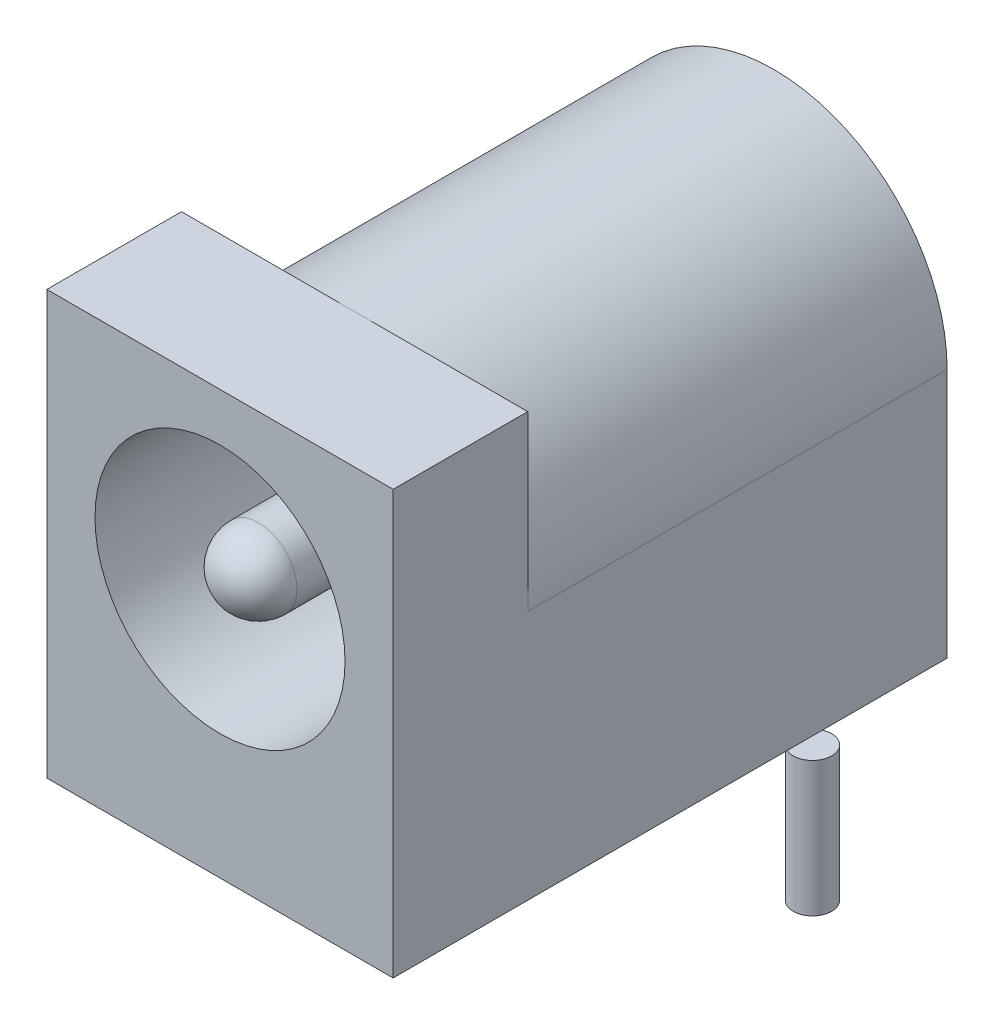
ISO-10303-21;
HEADER;
FILE_DESCRIPTION(('STEP AP214'),'2;1');
FILE_NAME('part.step','',(''),(''),'','','');
FILE_SCHEMA(('AUTOMOTIVE_DESIGN { 1 0 10303 214 1 1 1 1 }'));
ENDSEC;
DATA;
#1=APPLICATION_CONTEXT('core data for automotive mechanical design processes');
#2=APPLICATION_PROTOCOL_DEFINITION('international standard','automotive_design',2000,#1);
#3=PRODUCT_CONTEXT('',#1,'mechanical');
#4=PRODUCT('Part','Part','',(#3));
#5=PRODUCT_RELATED_PRODUCT_CATEGORY('part','',(#4));
#6=PRODUCT_DEFINITION_FORMATION('','',#4);
#7=PRODUCT_DEFINITION_CONTEXT('part definition',#1,'design');
#8=PRODUCT_DEFINITION('design','',#6,#7);
#9=PRODUCT_DEFINITION_SHAPE('','',#8);
#10=(LENGTH_UNIT() NAMED_UNIT(*) SI_UNIT(.MILLI.,.METRE.));
#11=(NAMED_UNIT(*) PLANE_ANGLE_UNIT() SI_UNIT($,.RADIAN.));
#12=(NAMED_UNIT(*) SI_UNIT($,.STERADIAN.) SOLID_ANGLE_UNIT());
#13=UNCERTAINTY_MEASURE_WITH_UNIT(LENGTH_MEASURE(1.E-05),#10,'distance_accuracy_value','');
#14=(GEOMETRIC_REPRESENTATION_CONTEXT(3) GLOBAL_UNCERTAINTY_ASSIGNED_CONTEXT((#13)) GLOBAL_UNIT_ASSIGNED_CONTEXT((#10,
#11,#12)) REPRESENTATION_CONTEXT('',''));
#15=CARTESIAN_POINT('',(0.,0.,0.));
#16=DIRECTION('',(0.,0.,1.));
#17=DIRECTION('',(1.,0.,0.));
#18=AXIS2_PLACEMENT_3D('',#15,#16,#17);
#19=CARTESIAN_POINT('',(-4.5,0.,-14.4));
#20=DIRECTION('',(-1.,0.,0.));
#21=DIRECTION('',(0.,0.,1.));
#22=AXIS2_PLACEMENT_3D('',#19,#20,#21);
#23=PLANE('',#22);
#24=DIRECTION('',(0.,-1.,0.));
#25=VECTOR('',#24,1.);
#26=CARTESIAN_POINT('',(-4.5,0.,0.));
#27=LINE('',#26,#25);
#28=CARTESIAN_POINT('',(-4.5,11.,0.));
#29=VERTEX_POINT('',#28);
#30=CARTESIAN_POINT('',(-4.5,0.,0.));
#31=VERTEX_POINT('',#30);
#32=EDGE_CURVE('E145',#29,#31,#27,.T.);
#33=ORIENTED_EDGE('',*,*,#32,.F.);
#34=DIRECTION('',(0.,0.,1.));
#35=VECTOR('',#34,1.);
#36=CARTESIAN_POINT('',(-4.5,11.,-3.5));
#37=LINE('',#36,#35);
#38=CARTESIAN_POINT('',(-4.5,11.,-3.5));
#39=VERTEX_POINT('',#38);
#40=EDGE_CURVE('E147',#39,#29,#37,.T.);
#41=ORIENTED_EDGE('',*,*,#40,.F.);
#42=DIRECTION('',(0.,-1.,0.));
#43=VECTOR('',#42,1.);
#44=CARTESIAN_POINT('',(-4.5,6.5,-3.5));
#45=LINE('',#44,#43);
#46=CARTESIAN_POINT('',(-4.5,6.5,-3.5));
#47=VERTEX_POINT('',#46);
#48=EDGE_CURVE('E160',#39,#47,#45,.T.);
#49=ORIENTED_EDGE('',*,*,#48,.T.);
#50=DIRECTION('',(0.,0.,1.));
#51=VECTOR('',#50,1.);
#52=CARTESIAN_POINT('',(-4.5,6.5,-14.4));
#53=LINE('',#52,#51);
#54=CARTESIAN_POINT('',(-4.5,6.5,-14.4));
#55=VERTEX_POINT('',#54);
#56=EDGE_CURVE('E58',#55,#47,#53,.T.);
#57=ORIENTED_EDGE('',*,*,#56,.F.);
#58=DIRECTION('',(0.,-1.,0.));
#59=VECTOR('',#58,1.);
#60=CARTESIAN_POINT('',(-4.5,0.,-14.4));
#61=LINE('',#60,#59);
#62=CARTESIAN_POINT('',(-4.5,0.,-14.4));
#63=VERTEX_POINT('',#62);
#64=EDGE_CURVE('E141',#55,#63,#61,.T.);
#65=ORIENTED_EDGE('',*,*,#64,.T.);
#66=DIRECTION('',(0.,0.,1.));
#67=VECTOR('',#66,1.);
#68=CARTESIAN_POINT('',(-4.5,0.,-14.4));
#69=LINE('',#68,#67);
#70=EDGE_CURVE('E80',#63,#31,#69,.T.);
#71=ORIENTED_EDGE('',*,*,#70,.T.);
#72=EDGE_LOOP('',(#33,#41,#49,#57,#65,#71));
#73=FACE_BOUND('',#72,.T.);
#74=ADVANCED_FACE('F35',(#73),#23,.T.);
#75=CARTESIAN_POINT('',(0.,6.5,-14.4));
#76=DIRECTION('',(0.,0.,1.));
#77=DIRECTION('',(1.,0.,0.));
#78=AXIS2_PLACEMENT_3D('',#75,#76,#77);
#79=CYLINDRICAL_SURFACE('',#78,4.5);
#80=CARTESIAN_POINT('',(0.,6.5,-3.5));
#81=DIRECTION('',(0.,0.,-1.));
#82=DIRECTION('',(-1.,0.,0.));
#83=AXIS2_PLACEMENT_3D('',#80,#81,#82);
#84=CIRCLE('',#83,4.5);
#85=CARTESIAN_POINT('',(4.5,6.5,-3.5));
#86=VERTEX_POINT('',#85);
#87=CARTESIAN_POINT('',(0.,11.,-3.5));
#88=VERTEX_POINT('',#87);
#89=EDGE_CURVE('E43',#86,#88,#84,.F.);
#90=ORIENTED_EDGE('',*,*,#89,.F.);
#91=DIRECTION('',(0.,0.,1.));
#92=VECTOR('',#91,1.);
#93=CARTESIAN_POINT('',(4.5,6.5,-14.4));
#94=LINE('',#93,#92);
#95=CARTESIAN_POINT('',(4.5,6.5,-14.4));
#96=VERTEX_POINT('',#95);
#97=EDGE_CURVE('E122',#96,#86,#94,.T.);
#98=ORIENTED_EDGE('',*,*,#97,.F.);
#99=CARTESIAN_POINT('',(0.,6.5,-14.4));
#100=DIRECTION('',(0.,0.,1.));
#101=DIRECTION('',(-1.,0.,0.));
#102=AXIS2_PLACEMENT_3D('',#99,#100,#101);
#103=CIRCLE('',#102,4.5);
#104=EDGE_CURVE('E126',#96,#55,#103,.T.);
#105=ORIENTED_EDGE('',*,*,#104,.T.);
#106=ORIENTED_EDGE('',*,*,#56,.T.);
#107=EDGE_CURVE('E131',#88,#47,#84,.F.);
#108=ORIENTED_EDGE('',*,*,#107,.F.);
#109=EDGE_LOOP('',(#90,#98,#105,#106,#108));
#110=FACE_BOUND('',#109,.T.);
#111=ADVANCED_FACE('F207',(#110),#79,.T.);
#112=CARTESIAN_POINT('',(4.5,6.5,-14.4));
#113=DIRECTION('',(1.,0.,0.));
#114=DIRECTION('',(0.,1.,0.));
#115=AXIS2_PLACEMENT_3D('',#112,#113,#114);
#116=PLANE('',#115);
#117=DIRECTION('',(0.,1.,0.));
#118=VECTOR('',#117,1.);
#119=CARTESIAN_POINT('',(4.5,6.5,0.));
#120=LINE('',#119,#118);
#121=CARTESIAN_POINT('',(4.5,0.,0.));
#122=VERTEX_POINT('',#121);
#123=CARTESIAN_POINT('',(4.5,11.,0.));
#124=VERTEX_POINT('',#123);
#125=EDGE_CURVE('E139',#122,#124,#120,.T.);
#126=ORIENTED_EDGE('',*,*,#125,.F.);
#127=DIRECTION('',(0.,0.,1.));
#128=VECTOR('',#127,1.);
#129=CARTESIAN_POINT('',(4.5,0.,-14.4));
#130=LINE('',#129,#128);
#131=CARTESIAN_POINT('',(4.5,0.,-10.2417424305044));
#132=VERTEX_POINT('',#131);
#133=EDGE_CURVE('E75',#132,#122,#130,.T.);
#134=ORIENTED_EDGE('',*,*,#133,.F.);
#135=CARTESIAN_POINT('',(4.5,0.,-11.1582575694956));
#136=VERTEX_POINT('',#135);
#137=EDGE_CURVE('E108',#136,#132,#130,.T.);
#138=ORIENTED_EDGE('',*,*,#137,.F.);
#139=CARTESIAN_POINT('',(4.5,0.,-14.4));
#140=VERTEX_POINT('',#139);
#141=EDGE_CURVE('E117',#140,#136,#130,.T.);
#142=ORIENTED_EDGE('',*,*,#141,.F.);
#143=DIRECTION('',(0.,1.,0.));
#144=VECTOR('',#143,1.);
#145=CARTESIAN_POINT('',(4.5,6.5,-14.4));
#146=LINE('',#145,#144);
#147=EDGE_CURVE('E129',#140,#96,#146,.T.);
#148=ORIENTED_EDGE('',*,*,#147,.T.);
#149=ORIENTED_EDGE('',*,*,#97,.T.);
#150=DIRECTION('',(0.,1.,0.));
#151=VECTOR('',#150,1.);
#152=CARTESIAN_POINT('',(4.5,6.5,-3.5));
#153=LINE('',#152,#151);
#154=CARTESIAN_POINT('',(4.5,11.,-3.5));
#155=VERTEX_POINT('',#154);
#156=EDGE_CURVE('E165',#86,#155,#153,.T.);
#157=ORIENTED_EDGE('',*,*,#156,.T.);
#158=DIRECTION('',(0.,0.,1.));
#159=VECTOR('',#158,1.);
#160=CARTESIAN_POINT('',(4.5,11.,-3.5));
#161=LINE('',#160,#159);
#162=EDGE_CURVE('E152',#155,#124,#161,.T.);
#163=ORIENTED_EDGE('',*,*,#162,.T.);
#164=EDGE_LOOP('',(#126,#134,#138,#142,#148,#149,#157,#163));
#165=FACE_BOUND('',#164,.T.);
#166=ADVANCED_FACE('F115',(#165),#116,.T.);
#167=CARTESIAN_POINT('',(4.5,0.,-14.4));
#168=DIRECTION('',(0.,-1.,0.));
#169=DIRECTION('',(0.,0.,-1.));
#170=AXIS2_PLACEMENT_3D('',#167,#168,#169);
#171=PLANE('',#170);
#172=CARTESIAN_POINT('',(0.,0.,-7.7));
#173=DIRECTION('',(0.,-1.,0.));
#174=DIRECTION('',(0.,0.,-1.));
#175=AXIS2_PLACEMENT_3D('',#172,#173,#174);
#176=CIRCLE('',#175,0.500000000000001);
#177=CARTESIAN_POINT('',(0.,0.,-8.2));
#178=VERTEX_POINT('',#177);
#179=EDGE_CURVE('E184',#178,#178,#176,.T.);
#180=ORIENTED_EDGE('',*,*,#179,.F.);
#181=EDGE_LOOP('',(#180));
#182=FACE_BOUND('',#181,.T.);
#183=CARTESIAN_POINT('',(0.,0.,-13.7));
#184=DIRECTION('',(0.,-1.,0.));
#185=DIRECTION('',(0.,0.,-1.));
#186=AXIS2_PLACEMENT_3D('',#183,#184,#185);
#187=CIRCLE('',#186,0.5);
#188=CARTESIAN_POINT('',(0.,0.,-14.2));
#189=VERTEX_POINT('',#188);
#190=EDGE_CURVE('E178',#189,#189,#187,.T.);
#191=ORIENTED_EDGE('',*,*,#190,.F.);
#192=EDGE_LOOP('',(#191));
#193=FACE_BOUND('',#192,.T.);
#194=ORIENTED_EDGE('',*,*,#141,.T.);
#195=CARTESIAN_POINT('',(4.7,0.,-10.7));
#196=DIRECTION('',(0.,-1.,0.));
#197=DIRECTION('',(0.,0.,-1.));
#198=AXIS2_PLACEMENT_3D('',#195,#196,#197);
#199=CIRCLE('',#198,0.500000000000002);
#200=EDGE_CURVE('E109',#132,#136,#199,.T.);
#201=ORIENTED_EDGE('',*,*,#200,.F.);
#202=ORIENTED_EDGE('',*,*,#133,.T.);
#203=DIRECTION('',(1.,0.,0.));
#204=VECTOR('',#203,1.);
#205=CARTESIAN_POINT('',(4.5,0.,0.));
#206=LINE('',#205,#204);
#207=EDGE_CURVE('E142',#31,#122,#206,.T.);
#208=ORIENTED_EDGE('',*,*,#207,.F.);
#209=ORIENTED_EDGE('',*,*,#70,.F.);
#210=DIRECTION('',(1.,0.,0.));
#211=VECTOR('',#210,1.);
#212=CARTESIAN_POINT('',(4.5,0.,-14.4));
#213=LINE('',#212,#211);
#214=EDGE_CURVE('E121',#63,#140,#213,.T.);
#215=ORIENTED_EDGE('',*,*,#214,.T.);
#216=EDGE_LOOP('',(#194,#201,#202,#208,#209,#215));
#217=FACE_BOUND('',#216,.T.);
#218=ADVANCED_FACE('F120',(#182,#193,#217),#171,.T.);
#219=CARTESIAN_POINT('',(0.,6.5,-14.4));
#220=DIRECTION('',(0.,0.,-1.));
#221=DIRECTION('',(-1.,0.,0.));
#222=AXIS2_PLACEMENT_3D('',#219,#220,#221);
#223=PLANE('',#222);
#224=ORIENTED_EDGE('',*,*,#64,.F.);
#225=ORIENTED_EDGE('',*,*,#104,.F.);
#226=ORIENTED_EDGE('',*,*,#147,.F.);
#227=ORIENTED_EDGE('',*,*,#214,.F.);
#228=EDGE_LOOP('',(#224,#225,#226,#227));
#229=FACE_BOUND('',#228,.T.);
#230=ADVANCED_FACE('F215',(#229),#223,.T.);
#231=CARTESIAN_POINT('',(0.,6.5,0.));
#232=DIRECTION('',(0.,0.,-1.));
#233=DIRECTION('',(-1.,0.,0.));
#234=AXIS2_PLACEMENT_3D('',#231,#232,#233);
#235=PLANE('',#234);
#236=CARTESIAN_POINT('',(0.,6.5,0.));
#237=DIRECTION('',(0.,0.,1.));
#238=DIRECTION('',(1.,0.,0.));
#239=AXIS2_PLACEMENT_3D('',#236,#237,#238);
#240=CIRCLE('',#239,3.25);
#241=CARTESIAN_POINT('',(3.25,6.5,0.));
#242=VERTEX_POINT('',#241);
#243=EDGE_CURVE('E169',#242,#242,#240,.T.);
#244=ORIENTED_EDGE('',*,*,#243,.F.);
#245=EDGE_LOOP('',(#244));
#246=FACE_BOUND('',#245,.T.);
#247=ORIENTED_EDGE('',*,*,#125,.T.);
#248=DIRECTION('',(-1.,0.,0.));
#249=VECTOR('',#248,1.);
#250=CARTESIAN_POINT('',(-4.5,11.,0.));
#251=LINE('',#250,#249);
#252=EDGE_CURVE('E158',#124,#29,#251,.T.);
#253=ORIENTED_EDGE('',*,*,#252,.T.);
#254=ORIENTED_EDGE('',*,*,#32,.T.);
#255=ORIENTED_EDGE('',*,*,#207,.T.);
#256=EDGE_LOOP('',(#247,#253,#254,#255));
#257=FACE_BOUND('',#256,.T.);
#258=ADVANCED_FACE('F219',(#246,#257),#235,.F.);
#259=CARTESIAN_POINT('',(0.,0.,-3.5));
#260=DIRECTION('',(0.,0.,-1.));
#261=DIRECTION('',(-1.,0.,0.));
#262=AXIS2_PLACEMENT_3D('',#259,#260,#261);
#263=PLANE('',#262);
#264=ORIENTED_EDGE('',*,*,#156,.F.);
#265=ORIENTED_EDGE('',*,*,#89,.T.);
#266=DIRECTION('',(-1.,0.,0.));
#267=VECTOR('',#266,1.);
#268=CARTESIAN_POINT('',(-4.5,11.,-3.5));
#269=LINE('',#268,#267);
#270=EDGE_CURVE('E155',#155,#88,#269,.T.);
#271=ORIENTED_EDGE('',*,*,#270,.F.);
#272=EDGE_LOOP('',(#264,#265,#271));
#273=FACE_BOUND('',#272,.T.);
#274=ADVANCED_FACE('F222',(#273),#263,.T.);
#275=CARTESIAN_POINT('',(-4.5,11.,-3.5));
#276=DIRECTION('',(0.,1.,0.));
#277=DIRECTION('',(0.,0.,1.));
#278=AXIS2_PLACEMENT_3D('',#275,#276,#277);
#279=PLANE('',#278);
#280=ORIENTED_EDGE('',*,*,#270,.T.);
#281=EDGE_CURVE('E164',#88,#39,#269,.T.);
#282=ORIENTED_EDGE('',*,*,#281,.T.);
#283=ORIENTED_EDGE('',*,*,#40,.T.);
#284=ORIENTED_EDGE('',*,*,#252,.F.);
#285=ORIENTED_EDGE('',*,*,#162,.F.);
#286=EDGE_LOOP('',(#280,#282,#283,#284,#285));
#287=FACE_BOUND('',#286,.T.);
#288=ADVANCED_FACE('F227',(#287),#279,.T.);
#289=ORIENTED_EDGE('',*,*,#281,.F.);
#290=ORIENTED_EDGE('',*,*,#107,.T.);
#291=ORIENTED_EDGE('',*,*,#48,.F.);
#292=EDGE_LOOP('',(#289,#290,#291));
#293=FACE_BOUND('',#292,.T.);
#294=ADVANCED_FACE('F230',(#293),#263,.T.);
#295=CARTESIAN_POINT('',(0.,6.5,-10.));
#296=DIRECTION('',(0.,0.,1.));
#297=DIRECTION('',(1.,0.,0.));
#298=AXIS2_PLACEMENT_3D('',#295,#296,#297);
#299=CYLINDRICAL_SURFACE('',#298,3.25);
#300=CARTESIAN_POINT('',(0.,6.5,-10.));
#301=DIRECTION('',(0.,0.,1.));
#302=DIRECTION('',(1.,0.,0.));
#303=AXIS2_PLACEMENT_3D('',#300,#301,#302);
#304=CIRCLE('',#303,3.25);
#305=CARTESIAN_POINT('',(3.25,6.5,-10.));
#306=VERTEX_POINT('',#305);
#307=EDGE_CURVE('E161',#306,#306,#304,.T.);
#308=ORIENTED_EDGE('',*,*,#307,.F.);
#309=EDGE_LOOP('',(#308));
#310=FACE_BOUND('',#309,.T.);
#311=ORIENTED_EDGE('',*,*,#243,.T.);
#312=EDGE_LOOP('',(#311));
#313=FACE_BOUND('',#312,.T.);
#314=ADVANCED_FACE('F234',(#310,#313),#299,.F.);
#315=CARTESIAN_POINT('',(0.,6.5,-10.));
#316=DIRECTION('',(0.,0.,1.));
#317=DIRECTION('',(1.,0.,0.));
#318=AXIS2_PLACEMENT_3D('',#315,#316,#317);
#319=PLANE('',#318);
#320=CARTESIAN_POINT('',(0.,6.5,-10.));
#321=DIRECTION('',(0.,0.,1.));
#322=DIRECTION('',(1.,0.,0.));
#323=AXIS2_PLACEMENT_3D('',#320,#321,#322);
#324=CIRCLE('',#323,1.);
#325=CARTESIAN_POINT('',(0.999999999999998,6.5,-10.));
#326=VERTEX_POINT('',#325);
#327=EDGE_CURVE('E172',#326,#326,#324,.T.);
#328=ORIENTED_EDGE('',*,*,#327,.F.);
#329=EDGE_LOOP('',(#328));
#330=FACE_BOUND('',#329,.T.);
#331=ORIENTED_EDGE('',*,*,#307,.T.);
#332=EDGE_LOOP('',(#331));
#333=FACE_BOUND('',#332,.T.);
#334=ADVANCED_FACE('F237',(#330,#333),#319,.T.);
#335=CARTESIAN_POINT('',(0.,6.5,-10.));
#336=DIRECTION('',(0.,0.,1.));
#337=DIRECTION('',(1.,0.,0.));
#338=AXIS2_PLACEMENT_3D('',#335,#336,#337);
#339=CYLINDRICAL_SURFACE('',#338,1.);
#340=CARTESIAN_POINT('',(0.,6.5,-0.999999999999999));
#341=DIRECTION('',(0.,0.,1.));
#342=DIRECTION('',(1.,0.,0.));
#343=AXIS2_PLACEMENT_3D('',#340,#341,#342);
#344=CIRCLE('',#343,1.);
#345=CARTESIAN_POINT('',(0.999999999999998,6.5,-0.999999999999999));
#346=VERTEX_POINT('',#345);
#347=EDGE_CURVE('E11',#346,#346,#344,.F.);
#348=ORIENTED_EDGE('',*,*,#347,.T.);
#349=EDGE_LOOP('',(#348));
#350=FACE_BOUND('',#349,.T.);
#351=ORIENTED_EDGE('',*,*,#327,.T.);
#352=EDGE_LOOP('',(#351));
#353=FACE_BOUND('',#352,.T.);
#354=ADVANCED_FACE('F241',(#350,#353),#339,.T.);
#355=CARTESIAN_POINT('',(0.,6.5,-0.999999999999999));
#356=DIRECTION('',(0.,0.,-1.));
#357=DIRECTION('',(-1.,0.,0.));
#358=AXIS2_PLACEMENT_3D('',#355,#356,#357);
#359=SPHERICAL_SURFACE('',#358,1.);
#360=ORIENTED_EDGE('',*,*,#347,.F.);
#361=EDGE_LOOP('',(#360));
#362=FACE_BOUND('',#361,.T.);
#363=ADVANCED_FACE('F37',(#362),#359,.T.);
#364=CARTESIAN_POINT('',(0.,-3.5,-13.7));
#365=DIRECTION('',(0.,1.,0.));
#366=DIRECTION('',(0.,0.,1.));
#367=AXIS2_PLACEMENT_3D('',#364,#365,#366);
#368=CYLINDRICAL_SURFACE('',#367,0.5);
#369=CARTESIAN_POINT('',(0.,-3.5,-13.7));
#370=DIRECTION('',(0.,-1.,0.));
#371=DIRECTION('',(0.,0.,-1.));
#372=AXIS2_PLACEMENT_3D('',#369,#370,#371);
#373=CIRCLE('',#372,0.5);
#374=CARTESIAN_POINT('',(0.,-3.5,-14.2));
#375=VERTEX_POINT('',#374);
#376=EDGE_CURVE('E177',#375,#375,#373,.T.);
#377=ORIENTED_EDGE('',*,*,#376,.F.);
#378=EDGE_LOOP('',(#377));
#379=FACE_BOUND('',#378,.T.);
#380=ORIENTED_EDGE('',*,*,#190,.T.);
#381=EDGE_LOOP('',(#380));
#382=FACE_BOUND('',#381,.T.);
#383=ADVANCED_FACE('F246',(#379,#382),#368,.T.);
#384=CARTESIAN_POINT('',(0.,-3.5,-13.7));
#385=DIRECTION('',(0.,-1.,0.));
#386=DIRECTION('',(0.,0.,-1.));
#387=AXIS2_PLACEMENT_3D('',#384,#385,#386);
#388=PLANE('',#387);
#389=ORIENTED_EDGE('',*,*,#376,.T.);
#390=EDGE_LOOP('',(#389));
#391=FACE_BOUND('',#390,.T.);
#392=ADVANCED_FACE('F249',(#391),#388,.T.);
#393=CARTESIAN_POINT('',(0.,-3.5,-7.7));
#394=DIRECTION('',(0.,1.,0.));
#395=DIRECTION('',(0.,0.,1.));
#396=AXIS2_PLACEMENT_3D('',#393,#394,#395);
#397=CYLINDRICAL_SURFACE('',#396,0.500000000000001);
#398=CARTESIAN_POINT('',(0.,-3.5,-7.7));
#399=DIRECTION('',(0.,-1.,0.));
#400=DIRECTION('',(0.,0.,-1.));
#401=AXIS2_PLACEMENT_3D('',#398,#399,#400);
#402=CIRCLE('',#401,0.500000000000001);
#403=CARTESIAN_POINT('',(0.,-3.5,-8.2));
#404=VERTEX_POINT('',#403);
#405=EDGE_CURVE('E181',#404,#404,#402,.T.);
#406=ORIENTED_EDGE('',*,*,#405,.F.);
#407=EDGE_LOOP('',(#406));
#408=FACE_BOUND('',#407,.T.);
#409=ORIENTED_EDGE('',*,*,#179,.T.);
#410=EDGE_LOOP('',(#409));
#411=FACE_BOUND('',#410,.T.);
#412=ADVANCED_FACE('F202',(#408,#411),#397,.T.);
#413=CARTESIAN_POINT('',(0.,-3.5,-7.7));
#414=DIRECTION('',(0.,-1.,0.));
#415=DIRECTION('',(0.,0.,-1.));
#416=AXIS2_PLACEMENT_3D('',#413,#414,#415);
#417=PLANE('',#416);
#418=ORIENTED_EDGE('',*,*,#405,.T.);
#419=EDGE_LOOP('',(#418));
#420=FACE_BOUND('',#419,.T.);
#421=ADVANCED_FACE('F195',(#420),#417,.T.);
#422=CARTESIAN_POINT('',(4.7,-3.5,-10.7));
#423=DIRECTION('',(0.,1.,0.));
#424=DIRECTION('',(0.,0.,1.));
#425=AXIS2_PLACEMENT_3D('',#422,#423,#424);
#426=CYLINDRICAL_SURFACE('',#425,0.500000000000002);
#427=CARTESIAN_POINT('',(4.7,-3.5,-10.7));
#428=DIRECTION('',(0.,-1.,0.));
#429=DIRECTION('',(0.,0.,-1.));
#430=AXIS2_PLACEMENT_3D('',#427,#428,#429);
#431=CIRCLE('',#430,0.500000000000002);
#432=CARTESIAN_POINT('',(4.7,-3.5,-11.2));
#433=VERTEX_POINT('',#432);
#434=EDGE_CURVE('E113',#433,#433,#431,.T.);
#435=ORIENTED_EDGE('',*,*,#434,.F.);
#436=EDGE_LOOP('',(#435));
#437=FACE_BOUND('',#436,.T.);
#438=ORIENTED_EDGE('',*,*,#200,.T.);
#439=EDGE_CURVE('E49',#136,#132,#199,.T.);
#440=ORIENTED_EDGE('',*,*,#439,.T.);
#441=EDGE_LOOP('',(#438,#440));
#442=FACE_BOUND('',#441,.T.);
#443=ADVANCED_FACE('F111',(#437,#442),#426,.T.);
#444=CARTESIAN_POINT('',(4.7,-3.5,-10.7));
#445=DIRECTION('',(0.,-1.,0.));
#446=DIRECTION('',(0.,0.,-1.));
#447=AXIS2_PLACEMENT_3D('',#444,#445,#446);
#448=PLANE('',#447);
#449=ORIENTED_EDGE('',*,*,#434,.T.);
#450=EDGE_LOOP('',(#449));
#451=FACE_BOUND('',#450,.T.);
#452=ADVANCED_FACE('F192',(#451),#448,.T.);
#453=CARTESIAN_POINT('',(4.7,0.,-10.7));
#454=DIRECTION('',(0.,-1.,0.));
#455=DIRECTION('',(0.,0.,-1.));
#456=AXIS2_PLACEMENT_3D('',#453,#454,#455);
#457=PLANE('',#456);
#458=ORIENTED_EDGE('',*,*,#137,.T.);
#459=ORIENTED_EDGE('',*,*,#439,.F.);
#460=EDGE_LOOP('',(#458,#459));
#461=FACE_BOUND('',#460,.T.);
#462=ADVANCED_FACE('F106',(#461),#457,.F.);
#463=CLOSED_SHELL('',(#74,#111,#166,#218,#230,#258,#274,#288,#294,#314,#334,#354,#363,#383,#392,
#412,#421,#443,#452,#462));
#464=MANIFOLD_SOLID_BREP('B2',#463);
#465=ADVANCED_BREP_SHAPE_REPRESENTATION('',(#18,#464),#14);
#466=SHAPE_DEFINITION_REPRESENTATION(#9,#465);
ENDSEC;
END-ISO-10303-21;
